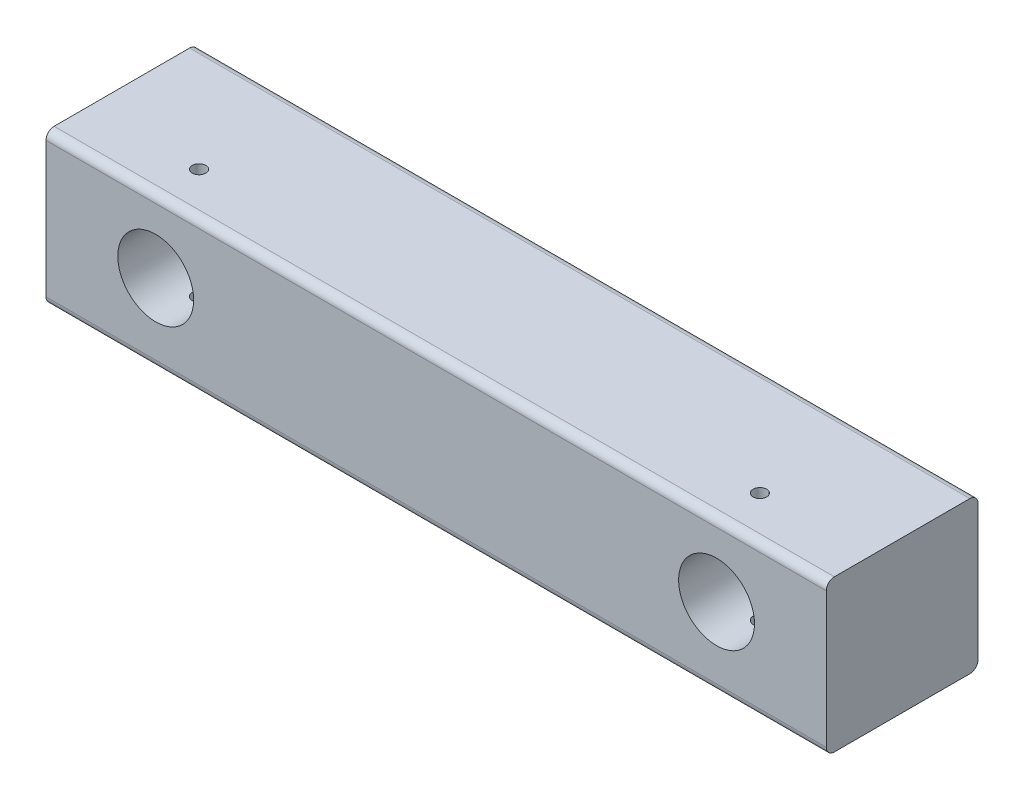
ISO-10303-21;
HEADER;
FILE_DESCRIPTION(('STEP AP214'),'2;1');
FILE_NAME('part.step','',(''),(''),'','','');
FILE_SCHEMA(('AUTOMOTIVE_DESIGN { 1 0 10303 214 1 1 1 1 }'));
ENDSEC;
DATA;
#1=APPLICATION_CONTEXT('core data for automotive mechanical design processes');
#2=APPLICATION_PROTOCOL_DEFINITION('international standard','automotive_design',2000,#1);
#3=PRODUCT_CONTEXT('',#1,'mechanical');
#4=PRODUCT('Part','Part','',(#3));
#5=PRODUCT_RELATED_PRODUCT_CATEGORY('part','',(#4));
#6=PRODUCT_DEFINITION_FORMATION('','',#4);
#7=PRODUCT_DEFINITION_CONTEXT('part definition',#1,'design');
#8=PRODUCT_DEFINITION('design','',#6,#7);
#9=PRODUCT_DEFINITION_SHAPE('','',#8);
#10=(LENGTH_UNIT() NAMED_UNIT(*) SI_UNIT(.MILLI.,.METRE.));
#11=(NAMED_UNIT(*) PLANE_ANGLE_UNIT() SI_UNIT($,.RADIAN.));
#12=(NAMED_UNIT(*) SI_UNIT($,.STERADIAN.) SOLID_ANGLE_UNIT());
#13=UNCERTAINTY_MEASURE_WITH_UNIT(LENGTH_MEASURE(1.E-05),#10,'distance_accuracy_value','');
#14=(GEOMETRIC_REPRESENTATION_CONTEXT(3) GLOBAL_UNCERTAINTY_ASSIGNED_CONTEXT((#13)) GLOBAL_UNIT_ASSIGNED_CONTEXT((#10,
#11,#12)) REPRESENTATION_CONTEXT('',''));
#15=CARTESIAN_POINT('',(0.,0.,0.));
#16=DIRECTION('',(0.,0.,1.));
#17=DIRECTION('',(1.,0.,0.));
#18=AXIS2_PLACEMENT_3D('',#15,#16,#17);
#19=CARTESIAN_POINT('',(0.,0.,-88.9));
#20=DIRECTION('',(0.,0.,-1.));
#21=DIRECTION('',(0.,1.,0.));
#22=AXIS2_PLACEMENT_3D('',#19,#20,#21);
#23=PLANE('',#22);
#24=CARTESIAN_POINT('',(164.309496882,-525.607187924995,-88.9));
#25=DIRECTION('',(0.,0.,1.));
#26=DIRECTION('',(1.,0.,0.));
#27=AXIS2_PLACEMENT_3D('',#24,#25,#26);
#28=CIRCLE('',#27,22.225);
#29=CARTESIAN_POINT('',(186.534496882,-525.607187924995,-88.9));
#30=VERTEX_POINT('',#29);
#31=EDGE_CURVE('E132',#30,#30,#28,.T.);
#32=ORIENTED_EDGE('',*,*,#31,.T.);
#33=EDGE_LOOP('',(#32));
#34=FACE_BOUND('',#33,.T.);
#35=CARTESIAN_POINT('',(-164.309496882,-525.607187924995,-88.9));
#36=DIRECTION('',(0.,0.,1.));
#37=DIRECTION('',(1.,0.,0.));
#38=AXIS2_PLACEMENT_3D('',#35,#36,#37);
#39=CIRCLE('',#38,22.225);
#40=CARTESIAN_POINT('',(-142.084496882,-525.607187924995,-88.9));
#41=VERTEX_POINT('',#40);
#42=EDGE_CURVE('E454',#41,#41,#39,.T.);
#43=ORIENTED_EDGE('',*,*,#42,.T.);
#44=EDGE_LOOP('',(#43));
#45=FACE_BOUND('',#44,.T.);
#46=DIRECTION('',(0.,-1.,0.));
#47=VECTOR('',#46,1.);
#48=CARTESIAN_POINT('',(-228.6,-571.993937924995,-88.9));
#49=LINE('',#48,#47);
#50=CARTESIAN_POINT('',(-228.6,-487.856437924995,-88.9));
#51=VERTEX_POINT('',#50);
#52=CARTESIAN_POINT('',(-228.6,-567.231437924995,-88.9));
#53=VERTEX_POINT('',#52);
#54=EDGE_CURVE('E144',#51,#53,#49,.T.);
#55=ORIENTED_EDGE('',*,*,#54,.F.);
#56=DIRECTION('',(-1.,0.,0.));
#57=VECTOR('',#56,1.);
#58=CARTESIAN_POINT('',(0.,-487.856437924995,-88.9));
#59=LINE('',#58,#57);
#60=CARTESIAN_POINT('',(228.6,-487.856437924995,-88.9));
#61=VERTEX_POINT('',#60);
#62=EDGE_CURVE('E11',#51,#61,#59,.F.);
#63=ORIENTED_EDGE('',*,*,#62,.T.);
#64=DIRECTION('',(0.,1.,0.));
#65=VECTOR('',#64,1.);
#66=CARTESIAN_POINT('',(228.6,-571.993937924995,-88.9));
#67=LINE('',#66,#65);
#68=CARTESIAN_POINT('',(228.6,-567.231437924995,-88.9));
#69=VERTEX_POINT('',#68);
#70=EDGE_CURVE('E148',#69,#61,#67,.T.);
#71=ORIENTED_EDGE('',*,*,#70,.F.);
#72=DIRECTION('',(1.,0.,0.));
#73=VECTOR('',#72,1.);
#74=CARTESIAN_POINT('',(0.,-567.231437924995,-88.9));
#75=LINE('',#74,#73);
#76=EDGE_CURVE('E47',#69,#53,#75,.F.);
#77=ORIENTED_EDGE('',*,*,#76,.T.);
#78=EDGE_LOOP('',(#55,#63,#71,#77));
#79=FACE_BOUND('',#78,.T.);
#80=ADVANCED_FACE('F38',(#34,#45,#79),#23,.T.);
#81=CARTESIAN_POINT('',(0.,0.,0.));
#82=DIRECTION('',(0.,0.,-1.));
#83=DIRECTION('',(-1.,0.,0.));
#84=AXIS2_PLACEMENT_3D('',#81,#82,#83);
#85=PLANE('',#84);
#86=CARTESIAN_POINT('',(164.309496882,-525.607187924995,0.));
#87=DIRECTION('',(0.,0.,1.));
#88=DIRECTION('',(1.,0.,0.));
#89=AXIS2_PLACEMENT_3D('',#86,#87,#88);
#90=CIRCLE('',#89,22.225);
#91=CARTESIAN_POINT('',(186.534496882,-525.607187924995,0.));
#92=VERTEX_POINT('',#91);
#93=EDGE_CURVE('E140',#92,#92,#90,.T.);
#94=ORIENTED_EDGE('',*,*,#93,.F.);
#95=EDGE_LOOP('',(#94));
#96=FACE_BOUND('',#95,.T.);
#97=CARTESIAN_POINT('',(-164.309496882,-525.607187924995,0.));
#98=DIRECTION('',(0.,0.,1.));
#99=DIRECTION('',(1.,0.,0.));
#100=AXIS2_PLACEMENT_3D('',#97,#98,#99);
#101=CIRCLE('',#100,22.225);
#102=CARTESIAN_POINT('',(-142.084496882,-525.607187924995,0.));
#103=VERTEX_POINT('',#102);
#104=EDGE_CURVE('E459',#103,#103,#101,.T.);
#105=ORIENTED_EDGE('',*,*,#104,.F.);
#106=EDGE_LOOP('',(#105));
#107=FACE_BOUND('',#106,.T.);
#108=DIRECTION('',(0.,-1.,0.));
#109=VECTOR('',#108,1.);
#110=CARTESIAN_POINT('',(-228.6,-571.993937924995,0.));
#111=LINE('',#110,#109);
#112=CARTESIAN_POINT('',(-228.6,-487.856437924995,0.));
#113=VERTEX_POINT('',#112);
#114=CARTESIAN_POINT('',(-228.6,-567.231437924995,0.));
#115=VERTEX_POINT('',#114);
#116=EDGE_CURVE('E119',#113,#115,#111,.T.);
#117=ORIENTED_EDGE('',*,*,#116,.T.);
#118=DIRECTION('',(1.,0.,0.));
#119=VECTOR('',#118,1.);
#120=CARTESIAN_POINT('',(228.6,-567.231437924995,0.));
#121=LINE('',#120,#119);
#122=CARTESIAN_POINT('',(228.6,-567.231437924995,0.));
#123=VERTEX_POINT('',#122);
#124=EDGE_CURVE('E124',#115,#123,#121,.T.);
#125=ORIENTED_EDGE('',*,*,#124,.T.);
#126=DIRECTION('',(0.,1.,0.));
#127=VECTOR('',#126,1.);
#128=CARTESIAN_POINT('',(228.6,-571.993937924995,0.));
#129=LINE('',#128,#127);
#130=CARTESIAN_POINT('',(228.6,-487.856437924995,0.));
#131=VERTEX_POINT('',#130);
#132=EDGE_CURVE('E122',#123,#131,#129,.T.);
#133=ORIENTED_EDGE('',*,*,#132,.T.);
#134=DIRECTION('',(-1.,0.,0.));
#135=VECTOR('',#134,1.);
#136=CARTESIAN_POINT('',(-228.6,-487.856437924995,0.));
#137=LINE('',#136,#135);
#138=EDGE_CURVE('E106',#131,#113,#137,.T.);
#139=ORIENTED_EDGE('',*,*,#138,.T.);
#140=EDGE_LOOP('',(#117,#125,#133,#139));
#141=FACE_BOUND('',#140,.T.);
#142=ADVANCED_FACE('F117',(#96,#107,#141),#85,.F.);
#143=CARTESIAN_POINT('',(-228.6,-571.993937924995,-554.662868850663));
#144=DIRECTION('',(0.,-1.,0.));
#145=DIRECTION('',(0.,0.,-1.));
#146=AXIS2_PLACEMENT_3D('',#143,#144,#145);
#147=PLANE('',#146);
#148=CARTESIAN_POINT('',(-164.309496882,-571.993937924995,-25.4));
#149=DIRECTION('',(0.,1.,0.));
#150=DIRECTION('',(0.,0.,1.));
#151=AXIS2_PLACEMENT_3D('',#148,#149,#150);
#152=CIRCLE('',#151,3.96874999999997);
#153=CARTESIAN_POINT('',(-164.309496882,-571.993937924995,-21.43125));
#154=VERTEX_POINT('',#153);
#155=EDGE_CURVE('E482',#154,#154,#152,.T.);
#156=ORIENTED_EDGE('',*,*,#155,.T.);
#157=EDGE_LOOP('',(#156));
#158=FACE_BOUND('',#157,.T.);
#159=CARTESIAN_POINT('',(164.309496882,-571.993937924995,-25.4));
#160=DIRECTION('',(0.,1.,0.));
#161=DIRECTION('',(0.,0.,1.));
#162=AXIS2_PLACEMENT_3D('',#159,#160,#161);
#163=CIRCLE('',#162,3.96874999999997);
#164=CARTESIAN_POINT('',(164.309496882,-571.993937924995,-21.43125));
#165=VERTEX_POINT('',#164);
#166=EDGE_CURVE('E173',#165,#165,#163,.T.);
#167=ORIENTED_EDGE('',*,*,#166,.T.);
#168=EDGE_LOOP('',(#167));
#169=FACE_BOUND('',#168,.T.);
#170=DIRECTION('',(0.,0.,1.));
#171=VECTOR('',#170,1.);
#172=CARTESIAN_POINT('',(228.6,-571.993937924995,-554.662868850663));
#173=LINE('',#172,#171);
#174=CARTESIAN_POINT('',(228.6,-571.993937924995,-84.1375));
#175=VERTEX_POINT('',#174);
#176=CARTESIAN_POINT('',(228.6,-571.993937924995,-4.7625));
#177=VERTEX_POINT('',#176);
#178=EDGE_CURVE('E137',#175,#177,#173,.T.);
#179=ORIENTED_EDGE('',*,*,#178,.T.);
#180=DIRECTION('',(1.,0.,0.));
#181=VECTOR('',#180,1.);
#182=CARTESIAN_POINT('',(-228.6,-571.993937924995,-4.7625));
#183=LINE('',#182,#181);
#184=CARTESIAN_POINT('',(-228.6,-571.993937924995,-4.7625));
#185=VERTEX_POINT('',#184);
#186=EDGE_CURVE('E112',#177,#185,#183,.F.);
#187=ORIENTED_EDGE('',*,*,#186,.T.);
#188=DIRECTION('',(0.,0.,1.));
#189=VECTOR('',#188,1.);
#190=CARTESIAN_POINT('',(-228.6,-571.993937924995,-554.662868850663));
#191=LINE('',#190,#189);
#192=CARTESIAN_POINT('',(-228.6,-571.993937924995,-84.1375));
#193=VERTEX_POINT('',#192);
#194=EDGE_CURVE('E125',#193,#185,#191,.T.);
#195=ORIENTED_EDGE('',*,*,#194,.F.);
#196=DIRECTION('',(1.,0.,0.));
#197=VECTOR('',#196,1.);
#198=CARTESIAN_POINT('',(-228.6,-571.993937924995,-84.1375));
#199=LINE('',#198,#197);
#200=EDGE_CURVE('E249',#193,#175,#199,.T.);
#201=ORIENTED_EDGE('',*,*,#200,.T.);
#202=EDGE_LOOP('',(#179,#187,#195,#201));
#203=FACE_BOUND('',#202,.T.);
#204=ADVANCED_FACE('F216',(#158,#169,#203),#147,.T.);
#205=CARTESIAN_POINT('',(228.6,-571.993937924995,-554.662868850663));
#206=DIRECTION('',(1.,0.,0.));
#207=DIRECTION('',(0.,0.,-1.));
#208=AXIS2_PLACEMENT_3D('',#205,#206,#207);
#209=PLANE('',#208);
#210=ORIENTED_EDGE('',*,*,#132,.F.);
#211=CARTESIAN_POINT('',(228.6,-567.231437924995,-4.7625));
#212=DIRECTION('',(1.,0.,0.));
#213=DIRECTION('',(0.,0.,-1.));
#214=AXIS2_PLACEMENT_3D('',#211,#212,#213);
#215=CIRCLE('',#214,4.7625);
#216=EDGE_CURVE('E286',#123,#177,#215,.T.);
#217=ORIENTED_EDGE('',*,*,#216,.T.);
#218=ORIENTED_EDGE('',*,*,#178,.F.);
#219=CARTESIAN_POINT('',(228.6,-567.231437924995,-84.1375));
#220=DIRECTION('',(1.,0.,0.));
#221=DIRECTION('',(0.,0.,-1.));
#222=AXIS2_PLACEMENT_3D('',#219,#220,#221);
#223=CIRCLE('',#222,4.7625);
#224=EDGE_CURVE('E279',#175,#69,#223,.T.);
#225=ORIENTED_EDGE('',*,*,#224,.T.);
#226=ORIENTED_EDGE('',*,*,#70,.T.);
#227=CARTESIAN_POINT('',(228.6,-487.856437924995,-84.1375));
#228=DIRECTION('',(1.,0.,0.));
#229=DIRECTION('',(0.,0.,-1.));
#230=AXIS2_PLACEMENT_3D('',#227,#228,#229);
#231=CIRCLE('',#230,4.7625);
#232=CARTESIAN_POINT('',(228.6,-483.093937924995,-84.1375));
#233=VERTEX_POINT('',#232);
#234=EDGE_CURVE('E277',#61,#233,#231,.T.);
#235=ORIENTED_EDGE('',*,*,#234,.T.);
#236=DIRECTION('',(0.,0.,1.));
#237=VECTOR('',#236,1.);
#238=CARTESIAN_POINT('',(228.6,-483.093937924995,-554.662868850663));
#239=LINE('',#238,#237);
#240=CARTESIAN_POINT('',(228.6,-483.093937924995,-4.7625));
#241=VERTEX_POINT('',#240);
#242=EDGE_CURVE('E152',#233,#241,#239,.T.);
#243=ORIENTED_EDGE('',*,*,#242,.T.);
#244=CARTESIAN_POINT('',(228.6,-487.856437924995,-4.7625));
#245=DIRECTION('',(1.,0.,0.));
#246=DIRECTION('',(0.,0.,-1.));
#247=AXIS2_PLACEMENT_3D('',#244,#245,#246);
#248=CIRCLE('',#247,4.7625);
#249=EDGE_CURVE('E281',#241,#131,#248,.T.);
#250=ORIENTED_EDGE('',*,*,#249,.T.);
#251=EDGE_LOOP('',(#210,#217,#218,#225,#226,#235,#243,#250));
#252=FACE_BOUND('',#251,.T.);
#253=ADVANCED_FACE('F223',(#252),#209,.T.);
#254=CARTESIAN_POINT('',(-228.6,-483.093937924995,-554.662868850663));
#255=DIRECTION('',(0.,1.,0.));
#256=DIRECTION('',(0.,0.,1.));
#257=AXIS2_PLACEMENT_3D('',#254,#255,#256);
#258=PLANE('',#257);
#259=CARTESIAN_POINT('',(-164.309496882,-483.093937924995,-25.4));
#260=DIRECTION('',(0.,1.,0.));
#261=DIRECTION('',(0.,0.,1.));
#262=AXIS2_PLACEMENT_3D('',#259,#260,#261);
#263=CIRCLE('',#262,3.96874999999999);
#264=CARTESIAN_POINT('',(-164.309496882,-483.093937924995,-21.43125));
#265=VERTEX_POINT('',#264);
#266=EDGE_CURVE('E486',#265,#265,#263,.T.);
#267=ORIENTED_EDGE('',*,*,#266,.F.);
#268=EDGE_LOOP('',(#267));
#269=FACE_BOUND('',#268,.T.);
#270=CARTESIAN_POINT('',(164.309496882,-483.093937924995,-25.4));
#271=DIRECTION('',(0.,1.,0.));
#272=DIRECTION('',(0.,0.,1.));
#273=AXIS2_PLACEMENT_3D('',#270,#271,#272);
#274=CIRCLE('',#273,3.96874999999999);
#275=CARTESIAN_POINT('',(164.309496882,-483.093937924995,-21.43125));
#276=VERTEX_POINT('',#275);
#277=EDGE_CURVE('E206',#276,#276,#274,.T.);
#278=ORIENTED_EDGE('',*,*,#277,.F.);
#279=EDGE_LOOP('',(#278));
#280=FACE_BOUND('',#279,.T.);
#281=ORIENTED_EDGE('',*,*,#242,.F.);
#282=DIRECTION('',(-1.,0.,0.));
#283=VECTOR('',#282,1.);
#284=CARTESIAN_POINT('',(-228.6,-483.093937924995,-84.1375));
#285=LINE('',#284,#283);
#286=CARTESIAN_POINT('',(-228.6,-483.093937924995,-84.1375));
#287=VERTEX_POINT('',#286);
#288=EDGE_CURVE('E262',#233,#287,#285,.T.);
#289=ORIENTED_EDGE('',*,*,#288,.T.);
#290=DIRECTION('',(0.,0.,1.));
#291=VECTOR('',#290,1.);
#292=CARTESIAN_POINT('',(-228.6,-483.093937924995,-554.662868850663));
#293=LINE('',#292,#291);
#294=CARTESIAN_POINT('',(-228.6,-483.093937924995,-4.7625));
#295=VERTEX_POINT('',#294);
#296=EDGE_CURVE('E147',#287,#295,#293,.T.);
#297=ORIENTED_EDGE('',*,*,#296,.T.);
#298=DIRECTION('',(-1.,0.,0.));
#299=VECTOR('',#298,1.);
#300=CARTESIAN_POINT('',(228.6,-483.093937924995,-4.7625));
#301=LINE('',#300,#299);
#302=EDGE_CURVE('E107',#295,#241,#301,.F.);
#303=ORIENTED_EDGE('',*,*,#302,.T.);
#304=EDGE_LOOP('',(#281,#289,#297,#303));
#305=FACE_BOUND('',#304,.T.);
#306=ADVANCED_FACE('F220',(#269,#280,#305),#258,.T.);
#307=CARTESIAN_POINT('',(-228.6,-571.993937924995,-554.662868850663));
#308=DIRECTION('',(-1.,0.,0.));
#309=DIRECTION('',(0.,0.,1.));
#310=AXIS2_PLACEMENT_3D('',#307,#308,#309);
#311=PLANE('',#310);
#312=ORIENTED_EDGE('',*,*,#194,.T.);
#313=CARTESIAN_POINT('',(-228.6,-567.231437924995,-4.7625));
#314=DIRECTION('',(-1.,0.,0.));
#315=DIRECTION('',(0.,0.,1.));
#316=AXIS2_PLACEMENT_3D('',#313,#314,#315);
#317=CIRCLE('',#316,4.7625);
#318=EDGE_CURVE('E130',#185,#115,#317,.T.);
#319=ORIENTED_EDGE('',*,*,#318,.T.);
#320=ORIENTED_EDGE('',*,*,#116,.F.);
#321=CARTESIAN_POINT('',(-228.6,-487.856437924995,-4.7625));
#322=DIRECTION('',(-1.,0.,0.));
#323=DIRECTION('',(0.,0.,1.));
#324=AXIS2_PLACEMENT_3D('',#321,#322,#323);
#325=CIRCLE('',#324,4.7625);
#326=EDGE_CURVE('E103',#113,#295,#325,.T.);
#327=ORIENTED_EDGE('',*,*,#326,.T.);
#328=ORIENTED_EDGE('',*,*,#296,.F.);
#329=CARTESIAN_POINT('',(-228.6,-487.856437924995,-84.1375));
#330=DIRECTION('',(-1.,0.,0.));
#331=DIRECTION('',(0.,0.,1.));
#332=AXIS2_PLACEMENT_3D('',#329,#330,#331);
#333=CIRCLE('',#332,4.7625);
#334=EDGE_CURVE('E60',#287,#51,#333,.T.);
#335=ORIENTED_EDGE('',*,*,#334,.T.);
#336=ORIENTED_EDGE('',*,*,#54,.T.);
#337=CARTESIAN_POINT('',(-228.6,-567.231437924995,-84.1375));
#338=DIRECTION('',(-1.,0.,0.));
#339=DIRECTION('',(0.,0.,1.));
#340=AXIS2_PLACEMENT_3D('',#337,#338,#339);
#341=CIRCLE('',#340,4.7625);
#342=EDGE_CURVE('E111',#53,#193,#341,.T.);
#343=ORIENTED_EDGE('',*,*,#342,.T.);
#344=EDGE_LOOP('',(#312,#319,#320,#327,#328,#335,#336,#343));
#345=FACE_BOUND('',#344,.T.);
#346=ADVANCED_FACE('F128',(#345),#311,.T.);
#347=CARTESIAN_POINT('',(-164.309496882,-525.607187924995,-88.9));
#348=DIRECTION('',(0.,0.,1.));
#349=DIRECTION('',(1.,0.,0.));
#350=AXIS2_PLACEMENT_3D('',#347,#348,#349);
#351=CYLINDRICAL_SURFACE('',#350,22.225);
#352=CARTESIAN_POINT('',(-164.309496882,-547.832187924995,-21.43125));
#353=CARTESIAN_POINT('',(-164.530539723004,-547.832184000619,-21.4312586401309));
#354=CARTESIAN_POINT('',(-164.751697227593,-547.828856109478,-21.4497791451399));
#355=CARTESIAN_POINT('',(-165.187793102213,-547.815901114411,-21.5233316141319));
#356=CARTESIAN_POINT('',(-165.402725842524,-547.806268483454,-21.5783956144551));
#357=CARTESIAN_POINT('',(-165.820001093655,-547.781782823664,-21.7233059202654));
#358=CARTESIAN_POINT('',(-166.022354327872,-547.766934314968,-21.8131221159348));
#359=CARTESIAN_POINT('',(-166.409097305582,-547.733643279863,-22.0249046550446));
#360=CARTESIAN_POINT('',(-166.593488764642,-547.715201097199,-22.1468679239167));
#361=CARTESIAN_POINT('',(-166.941107448157,-547.676537240423,-22.4208962506653));
#362=CARTESIAN_POINT('',(-167.104110324237,-547.656299942581,-22.5732437311701));
#363=CARTESIAN_POINT('',(-167.402385211821,-547.616444271707,-22.9031081648908));
#364=CARTESIAN_POINT('',(-167.537655341539,-547.596825940751,-23.0806268246981));
#365=CARTESIAN_POINT('',(-167.777543103891,-547.560277912596,-23.4573605609177));
#366=CARTESIAN_POINT('',(-167.8819353165,-547.543368381872,-23.6567213029918));
#367=CARTESIAN_POINT('',(-168.055661572932,-547.514371257378,-24.0705023393799));
#368=CARTESIAN_POINT('',(-168.124998347606,-547.502283288021,-24.2849214591491));
#369=CARTESIAN_POINT('',(-168.225931249032,-547.484454481447,-24.7203417539961));
#370=CARTESIAN_POINT('',(-168.257916937327,-547.478648176016,-24.9412498937873));
#371=CARTESIAN_POINT('',(-168.284448301456,-547.473842455249,-25.3853678886866));
#372=CARTESIAN_POINT('',(-168.278997019875,-547.474842486747,-25.6085775552725));
#373=CARTESIAN_POINT('',(-168.231125698518,-547.48347676658,-26.0481586246805));
#374=CARTESIAN_POINT('',(-168.189146247321,-547.491031946148,-26.2645797895286));
#375=CARTESIAN_POINT('',(-168.070103016254,-547.511801241172,-26.6872571354414));
#376=CARTESIAN_POINT('',(-167.993037871933,-547.525015576705,-26.893512920838));
#377=CARTESIAN_POINT('',(-167.805573008267,-547.555698139892,-27.2913069852049));
#378=CARTESIAN_POINT('',(-167.694993157032,-547.573189253298,-27.4827585370541));
#379=CARTESIAN_POINT('',(-167.443765445275,-547.6104391088,-27.844555534767));
#380=CARTESIAN_POINT('',(-167.30311480859,-547.630198060188,-28.0148990296199));
#381=CARTESIAN_POINT('',(-166.993351510892,-547.670103079664,-28.3321922207374));
#382=CARTESIAN_POINT('',(-166.823861474033,-547.690250649319,-28.4787735572925));
#383=CARTESIAN_POINT('',(-166.462499309227,-547.728403105903,-28.7414749859914));
#384=CARTESIAN_POINT('',(-166.270626994675,-547.746407974965,-28.8575948241448));
#385=CARTESIAN_POINT('',(-165.869579368589,-547.778277756257,-29.0561220751178));
#386=CARTESIAN_POINT('',(-165.660385986624,-547.792138273542,-29.1384937331479));
#387=CARTESIAN_POINT('',(-165.230830131145,-547.814123159198,-29.2668275504797));
#388=CARTESIAN_POINT('',(-165.010468734379,-547.822248079436,-29.3127932127407));
#389=CARTESIAN_POINT('',(-164.568003771293,-547.83177121633,-29.3665034430965));
#390=CARTESIAN_POINT('',(-164.345963371579,-547.833258327389,-29.37475314482));
#391=CARTESIAN_POINT('',(-163.903674791911,-547.829582922889,-29.3541485881257));
#392=CARTESIAN_POINT('',(-163.683426532834,-547.824420702519,-29.3252959768182));
#393=CARTESIAN_POINT('',(-163.252557940065,-547.808081869981,-29.2317258923966));
#394=CARTESIAN_POINT('',(-163.041880878068,-547.79694772783,-29.1672615802417));
#395=CARTESIAN_POINT('',(-162.634324548622,-547.769908287485,-29.0045701495806));
#396=CARTESIAN_POINT('',(-162.437446149337,-547.754002689418,-28.9063409089945));
#397=CARTESIAN_POINT('',(-162.060902986521,-547.718963200154,-28.6777728086266));
#398=CARTESIAN_POINT('',(-161.881430350458,-547.699798574866,-28.5471222434305));
#399=CARTESIAN_POINT('',(-161.546775982049,-547.660451667494,-28.2578450414398));
#400=CARTESIAN_POINT('',(-161.391596295425,-547.640269299893,-28.0992160509579));
#401=CARTESIAN_POINT('',(-161.10803406254,-547.60086995237,-27.7562072363195));
#402=CARTESIAN_POINT('',(-160.979994760194,-547.581667431653,-27.5715417248734));
#403=CARTESIAN_POINT('',(-160.756754002146,-547.546683457973,-27.183026518));
#404=CARTESIAN_POINT('',(-160.661551400245,-547.530901885604,-26.9791774925105));
#405=CARTESIAN_POINT('',(-160.507185046116,-547.504657947021,-26.5589921974404));
#406=CARTESIAN_POINT('',(-160.447858000571,-547.494171515688,-26.3427174903262));
#407=CARTESIAN_POINT('',(-160.366418409723,-547.479647739819,-25.9030671689553));
#408=CARTESIAN_POINT('',(-160.344302097364,-547.475609742475,-25.679692275824));
#409=CARTESIAN_POINT('',(-160.338028609234,-547.474470968887,-25.2356156308689));
#410=CARTESIAN_POINT('',(-160.353330549439,-547.477271342598,-25.0149215900373));
#411=CARTESIAN_POINT('',(-160.420281485391,-547.489275717869,-24.5793040638963));
#412=CARTESIAN_POINT('',(-160.471930310238,-547.498479689321,-24.3643805514594));
#413=CARTESIAN_POINT('',(-160.609889824388,-547.522214355847,-23.946659821797));
#414=CARTESIAN_POINT('',(-160.696147229829,-547.536736859449,-23.7438445115396));
#415=CARTESIAN_POINT('',(-160.900817928849,-547.569478941969,-23.3554771023942));
#416=CARTESIAN_POINT('',(-161.019233198785,-547.587698748099,-23.1699260654743));
#417=CARTESIAN_POINT('',(-161.286760874068,-547.626092289508,-22.8186344372683));
#418=CARTESIAN_POINT('',(-161.436268866156,-547.646289228702,-22.6531975946076));
#419=CARTESIAN_POINT('',(-161.760908511349,-547.686182761602,-22.3495777830286));
#420=CARTESIAN_POINT('',(-161.936046050363,-547.705879239152,-22.2114010916548));
#421=CARTESIAN_POINT('',(-162.308658321768,-547.742737805255,-21.9651932936352));
#422=CARTESIAN_POINT('',(-162.506301609698,-547.759878202375,-21.8574139632159));
#423=CARTESIAN_POINT('',(-162.917124698198,-547.789482129106,-21.6767581397728));
#424=CARTESIAN_POINT('',(-163.130289283669,-547.80195016711,-21.6038479823726));
#425=CARTESIAN_POINT('',(-163.505060220157,-547.818182958045,-21.5102589012337));
#426=CARTESIAN_POINT('',(-163.664440279571,-547.823405870528,-21.480679770113));
#427=CARTESIAN_POINT('',(-163.985692043138,-547.830409754377,-21.4411723664841));
#428=CARTESIAN_POINT('',(-164.147563693501,-547.832190799943,-21.4312436703494));
#429=CARTESIAN_POINT('',(-164.309496882,-547.832187924995,-21.43125));
#430=B_SPLINE_CURVE_WITH_KNOTS('',3,(#352,#353,#354,#355,#356,#357,#358,#359,#360,#361,#362,
#363,#364,#365,#366,#367,#368,#369,#370,#371,#372,#373,#374,#375,#376,#377,#378,#379,#380,#381,
#382,#383,#384,#385,#386,#387,#388,#389,#390,#391,#392,#393,#394,#395,#396,#397,#398,#399,#400,
#401,#402,#403,#404,#405,#406,#407,#408,#409,#410,#411,#412,#413,#414,#415,#416,#417,#418,#419,
#420,#421,#422,#423,#424,#425,#426,#427,#428,#429),.UNSPECIFIED.,.T.,.F.,(4,2,2,2,2,2,2,2,2,2,2,
2,2,2,2,2,2,2,2,2,2,2,2,2,2,2,2,2,2,2,2,2,2,2,2,2,2,2,4),(0.,0.662536452327345,1.32565449463126,
1.98819928351543,2.65068072913821,3.3196338990258,3.98863244525344,4.66240076645074,
5.33611659235369,6.00274114979633,6.66931152984555,7.32795172752227,7.98661754131183,
8.64888823614722,9.31122009886095,9.98299974902709,10.6547850003654,11.3272801510865,
11.9997105869367,12.663108192618,13.3264763486183,13.9851882498057,14.6439415577134,
15.309291842749,15.974698127151,16.6480747298488,17.3214278252207,17.9916925136016,
18.6618893431769,19.3224558361061,19.9830192231395,20.6425694762409,21.3021602731231,
21.9707216917796,22.6394368893943,23.3135383445744,23.986987669377,24.4723639552993,
24.9577297773034),.UNSPECIFIED.);
#431=CARTESIAN_POINT('',(-164.309496882,-547.832187924995,-21.43125));
#432=VERTEX_POINT('',#431);
#433=EDGE_CURVE('E200',#432,#432,#430,.T.);
#434=ORIENTED_EDGE('',*,*,#433,.T.);
#435=EDGE_LOOP('',(#434));
#436=FACE_BOUND('',#435,.T.);
#437=CARTESIAN_POINT('',(-164.309496882,-503.382187924995,-21.43125));
#438=CARTESIAN_POINT('',(-164.088454040996,-503.382191849371,-21.4312586401309));
#439=CARTESIAN_POINT('',(-163.867296536407,-503.385519740512,-21.4497791451399));
#440=CARTESIAN_POINT('',(-163.431200661787,-503.398474735579,-21.5233316141319));
#441=CARTESIAN_POINT('',(-163.216267921476,-503.408107366536,-21.5783956144551));
#442=CARTESIAN_POINT('',(-162.798992670345,-503.432593026326,-21.7233059202654));
#443=CARTESIAN_POINT('',(-162.596639436128,-503.447441535022,-21.8131221159349));
#444=CARTESIAN_POINT('',(-162.209896458418,-503.480732570127,-22.0249046550446));
#445=CARTESIAN_POINT('',(-162.025504999358,-503.499174752791,-22.1468679239167));
#446=CARTESIAN_POINT('',(-161.677886315843,-503.537838609566,-22.4208962506653));
#447=CARTESIAN_POINT('',(-161.514883439763,-503.558075907409,-22.5732437311701));
#448=CARTESIAN_POINT('',(-161.216608552179,-503.597931578283,-22.9031081648908));
#449=CARTESIAN_POINT('',(-161.081338422461,-503.617549909239,-23.0806268246981));
#450=CARTESIAN_POINT('',(-160.841450660109,-503.654097937394,-23.4573605609177));
#451=CARTESIAN_POINT('',(-160.737058447499,-503.671007468118,-23.6567213029918));
#452=CARTESIAN_POINT('',(-160.563332191068,-503.700004592612,-24.0705023393799));
#453=CARTESIAN_POINT('',(-160.493995416394,-503.712092561969,-24.2849214591491));
#454=CARTESIAN_POINT('',(-160.393062514967,-503.729921368542,-24.7203417539961));
#455=CARTESIAN_POINT('',(-160.361076826673,-503.735727673974,-24.9412498937873));
#456=CARTESIAN_POINT('',(-160.334545462544,-503.740533394741,-25.3853678886866));
#457=CARTESIAN_POINT('',(-160.339996744125,-503.739533363243,-25.6085775552725));
#458=CARTESIAN_POINT('',(-160.387868065482,-503.73089908341,-26.0481586246805));
#459=CARTESIAN_POINT('',(-160.429847516679,-503.723343903842,-26.2645797895286));
#460=CARTESIAN_POINT('',(-160.548890747746,-503.702574608818,-26.6872571354414));
#461=CARTESIAN_POINT('',(-160.625955892067,-503.689360273285,-26.893512920838));
#462=CARTESIAN_POINT('',(-160.813420755732,-503.658677710098,-27.2913069852049));
#463=CARTESIAN_POINT('',(-160.924000606968,-503.641186596692,-27.4827585370541));
#464=CARTESIAN_POINT('',(-161.175228318725,-503.60393674119,-27.844555534767));
#465=CARTESIAN_POINT('',(-161.31587895541,-503.584177789802,-28.0148990296199));
#466=CARTESIAN_POINT('',(-161.625642253108,-503.544272770326,-28.3321922207374));
#467=CARTESIAN_POINT('',(-161.795132289967,-503.524125200671,-28.4787735572925));
#468=CARTESIAN_POINT('',(-162.156494454773,-503.485972744087,-28.7414749859914));
#469=CARTESIAN_POINT('',(-162.348366769325,-503.467967875025,-28.8575948241448));
#470=CARTESIAN_POINT('',(-162.749414395411,-503.436098093733,-29.0561220751178));
#471=CARTESIAN_POINT('',(-162.958607777376,-503.422237576448,-29.1384937331479));
#472=CARTESIAN_POINT('',(-163.388163632855,-503.400252690792,-29.2668275504797));
#473=CARTESIAN_POINT('',(-163.608525029621,-503.392127770554,-29.3127932127407));
#474=CARTESIAN_POINT('',(-164.050989992706,-503.38260463366,-29.3665034430965));
#475=CARTESIAN_POINT('',(-164.273030392421,-503.381117522601,-29.37475314482));
#476=CARTESIAN_POINT('',(-164.715318972089,-503.3847929271,-29.3541485881257));
#477=CARTESIAN_POINT('',(-164.935567231166,-503.389955147471,-29.3252959768182));
#478=CARTESIAN_POINT('',(-165.366435823935,-503.406293980008,-29.2317258923966));
#479=CARTESIAN_POINT('',(-165.577112885932,-503.417428122159,-29.1672615802417));
#480=CARTESIAN_POINT('',(-165.984669215378,-503.444467562505,-29.0045701495806));
#481=CARTESIAN_POINT('',(-166.181547614663,-503.460373160572,-28.9063409089945));
#482=CARTESIAN_POINT('',(-166.558090777479,-503.495412649836,-28.6777728086266));
#483=CARTESIAN_POINT('',(-166.737563413542,-503.514577275124,-28.5471222434305));
#484=CARTESIAN_POINT('',(-167.072217781951,-503.553924182496,-28.2578450414398));
#485=CARTESIAN_POINT('',(-167.227397468575,-503.574106550097,-28.0992160509579));
#486=CARTESIAN_POINT('',(-167.51095970146,-503.61350589762,-27.7562072363195));
#487=CARTESIAN_POINT('',(-167.638999003806,-503.632708418337,-27.5715417248734));
#488=CARTESIAN_POINT('',(-167.862239761854,-503.667692392017,-27.183026518));
#489=CARTESIAN_POINT('',(-167.957442363755,-503.683473964386,-26.9791774925105));
#490=CARTESIAN_POINT('',(-168.111808717884,-503.709717902969,-26.5589921974404));
#491=CARTESIAN_POINT('',(-168.171135763429,-503.720204334302,-26.3427174903262));
#492=CARTESIAN_POINT('',(-168.252575354277,-503.734728110171,-25.9030671689553));
#493=CARTESIAN_POINT('',(-168.274691666636,-503.738766107515,-25.679692275824));
#494=CARTESIAN_POINT('',(-168.280965154766,-503.739904881103,-25.2356156308689));
#495=CARTESIAN_POINT('',(-168.265663214561,-503.737104507392,-25.0149215900373));
#496=CARTESIAN_POINT('',(-168.198712278609,-503.72510013212,-24.5793040638963));
#497=CARTESIAN_POINT('',(-168.147063453762,-503.715896160669,-24.3643805514594));
#498=CARTESIAN_POINT('',(-168.009103939612,-503.692161494143,-23.946659821797));
#499=CARTESIAN_POINT('',(-167.922846534171,-503.677638990541,-23.7438445115396));
#500=CARTESIAN_POINT('',(-167.718175835151,-503.644896908021,-23.3554771023942));
#501=CARTESIAN_POINT('',(-167.599760565215,-503.626677101891,-23.1699260654743));
#502=CARTESIAN_POINT('',(-167.332232889932,-503.588283560482,-22.8186344372683));
#503=CARTESIAN_POINT('',(-167.182724897844,-503.568086621288,-22.6531975946076));
#504=CARTESIAN_POINT('',(-166.858085252651,-503.528193088388,-22.3495777830286));
#505=CARTESIAN_POINT('',(-166.682947713637,-503.508496610838,-22.2114010916548));
#506=CARTESIAN_POINT('',(-166.310335442232,-503.471638044735,-21.9651932936352));
#507=CARTESIAN_POINT('',(-166.112692154302,-503.454497647615,-21.8574139632159));
#508=CARTESIAN_POINT('',(-165.701869065802,-503.424893720884,-21.6767581397728));
#509=CARTESIAN_POINT('',(-165.488704480331,-503.41242568288,-21.6038479823726));
#510=CARTESIAN_POINT('',(-165.113933543843,-503.396192891945,-21.5102589012337));
#511=CARTESIAN_POINT('',(-164.954553484429,-503.390969979462,-21.480679770113));
#512=CARTESIAN_POINT('',(-164.633301720862,-503.383966095613,-21.4411723664841));
#513=CARTESIAN_POINT('',(-164.471430070499,-503.382185050047,-21.4312436703494));
#514=CARTESIAN_POINT('',(-164.309496882,-503.382187924995,-21.43125));
#515=B_SPLINE_CURVE_WITH_KNOTS('',3,(#437,#438,#439,#440,#441,#442,#443,#444,#445,#446,#447,
#448,#449,#450,#451,#452,#453,#454,#455,#456,#457,#458,#459,#460,#461,#462,#463,#464,#465,#466,
#467,#468,#469,#470,#471,#472,#473,#474,#475,#476,#477,#478,#479,#480,#481,#482,#483,#484,#485,
#486,#487,#488,#489,#490,#491,#492,#493,#494,#495,#496,#497,#498,#499,#500,#501,#502,#503,#504,
#505,#506,#507,#508,#509,#510,#511,#512,#513,#514),.UNSPECIFIED.,.T.,.F.,(4,2,2,2,2,2,2,2,2,2,2,
2,2,2,2,2,2,2,2,2,2,2,2,2,2,2,2,2,2,2,2,2,2,2,2,2,2,2,4),(0.,0.662536452327345,1.32565449463126,
1.98819928351543,2.6506807291382,3.31963389902577,3.98863244525344,4.66240076645074,
5.33611659235369,6.00274114979632,6.66931152984555,7.32795172752226,7.98661754131183,
8.64888823614722,9.31122009886094,9.98299974902709,10.6547850003654,11.3272801510865,
11.9997105869367,12.663108192618,13.3264763486182,13.9851882498056,14.6439415577134,
15.309291842749,15.974698127151,16.6480747298488,17.3214278252207,17.9916925136016,
18.6618893431769,19.3224558361061,19.9830192231394,20.6425694762409,21.3021602731231,
21.9707216917796,22.6394368893943,23.3135383445744,23.986987669377,24.4723639552993,
24.9577297773034),.UNSPECIFIED.);
#516=CARTESIAN_POINT('',(-164.309496882,-503.382187924995,-21.43125));
#517=VERTEX_POINT('',#516);
#518=EDGE_CURVE('E195',#517,#517,#515,.T.);
#519=ORIENTED_EDGE('',*,*,#518,.T.);
#520=EDGE_LOOP('',(#519));
#521=FACE_BOUND('',#520,.T.);
#522=ORIENTED_EDGE('',*,*,#42,.F.);
#523=EDGE_LOOP('',(#522));
#524=FACE_BOUND('',#523,.T.);
#525=ORIENTED_EDGE('',*,*,#104,.T.);
#526=EDGE_LOOP('',(#525));
#527=FACE_BOUND('',#526,.T.);
#528=ADVANCED_FACE('F208',(#436,#521,#524,#527),#351,.F.);
#529=CARTESIAN_POINT('',(164.309496882,-525.607187924995,-88.9));
#530=DIRECTION('',(0.,0.,1.));
#531=DIRECTION('',(1.,0.,0.));
#532=AXIS2_PLACEMENT_3D('',#529,#530,#531);
#533=CYLINDRICAL_SURFACE('',#532,22.225);
#534=CARTESIAN_POINT('',(164.309496882,-547.832187924995,-21.43125));
#535=CARTESIAN_POINT('',(164.088454040996,-547.832184000619,-21.4312586401309));
#536=CARTESIAN_POINT('',(163.867296536407,-547.828856109477,-21.44977914514));
#537=CARTESIAN_POINT('',(163.431200661787,-547.815901114411,-21.5233316141319));
#538=CARTESIAN_POINT('',(163.216267921476,-547.806268483454,-21.5783956144551));
#539=CARTESIAN_POINT('',(162.798992670345,-547.781782823664,-21.7233059202654));
#540=CARTESIAN_POINT('',(162.596639436128,-547.766934314968,-21.8131221159349));
#541=CARTESIAN_POINT('',(162.209896458418,-547.733643279863,-22.0249046550446));
#542=CARTESIAN_POINT('',(162.025504999358,-547.715201097199,-22.1468679239167));
#543=CARTESIAN_POINT('',(161.677886315843,-547.676537240423,-22.4208962506654));
#544=CARTESIAN_POINT('',(161.514883439763,-547.656299942581,-22.5732437311701));
#545=CARTESIAN_POINT('',(161.216608552179,-547.616444271707,-22.9031081648908));
#546=CARTESIAN_POINT('',(161.081338422461,-547.596825940751,-23.0806268246981));
#547=CARTESIAN_POINT('',(160.841450660109,-547.560277912596,-23.4573605609177));
#548=CARTESIAN_POINT('',(160.7370584475,-547.543368381872,-23.6567213029918));
#549=CARTESIAN_POINT('',(160.563332191068,-547.514371257378,-24.0705023393799));
#550=CARTESIAN_POINT('',(160.493995416394,-547.50228328802,-24.2849214591491));
#551=CARTESIAN_POINT('',(160.393062514968,-547.484454481447,-24.7203417539961));
#552=CARTESIAN_POINT('',(160.361076826673,-547.478648176016,-24.9412498937873));
#553=CARTESIAN_POINT('',(160.334545462544,-547.473842455249,-25.3853678886867));
#554=CARTESIAN_POINT('',(160.339996744125,-547.474842486747,-25.6085775552725));
#555=CARTESIAN_POINT('',(160.387868065482,-547.48347676658,-26.0481586246805));
#556=CARTESIAN_POINT('',(160.429847516679,-547.491031946148,-26.2645797895286));
#557=CARTESIAN_POINT('',(160.548890747746,-547.511801241172,-26.6872571354414));
#558=CARTESIAN_POINT('',(160.625955892067,-547.525015576705,-26.893512920838));
#559=CARTESIAN_POINT('',(160.813420755733,-547.555698139892,-27.2913069852049));
#560=CARTESIAN_POINT('',(160.924000606968,-547.573189253298,-27.4827585370541));
#561=CARTESIAN_POINT('',(161.175228318725,-547.6104391088,-27.8445555347671));
#562=CARTESIAN_POINT('',(161.31587895541,-547.630198060188,-28.01489902962));
#563=CARTESIAN_POINT('',(161.625642253108,-547.670103079664,-28.3321922207374));
#564=CARTESIAN_POINT('',(161.795132289967,-547.690250649319,-28.4787735572926));
#565=CARTESIAN_POINT('',(162.156494454773,-547.728403105903,-28.7414749859914));
#566=CARTESIAN_POINT('',(162.348366769325,-547.746407974964,-28.8575948241449));
#567=CARTESIAN_POINT('',(162.749414395411,-547.778277756257,-29.0561220751178));
#568=CARTESIAN_POINT('',(162.958607777376,-547.792138273542,-29.1384937331479));
#569=CARTESIAN_POINT('',(163.388163632855,-547.814123159198,-29.2668275504797));
#570=CARTESIAN_POINT('',(163.608525029621,-547.822248079435,-29.3127932127407));
#571=CARTESIAN_POINT('',(164.050989992707,-547.83177121633,-29.3665034430965));
#572=CARTESIAN_POINT('',(164.273030392421,-547.833258327389,-29.37475314482));
#573=CARTESIAN_POINT('',(164.715318972089,-547.829582922889,-29.3541485881257));
#574=CARTESIAN_POINT('',(164.935567231166,-547.824420702519,-29.3252959768182));
#575=CARTESIAN_POINT('',(165.366435823935,-547.808081869981,-29.2317258923966));
#576=CARTESIAN_POINT('',(165.577112885932,-547.79694772783,-29.1672615802417));
#577=CARTESIAN_POINT('',(165.984669215378,-547.769908287485,-29.0045701495806));
#578=CARTESIAN_POINT('',(166.181547614663,-547.754002689418,-28.9063409089945));
#579=CARTESIAN_POINT('',(166.558090777479,-547.718963200154,-28.6777728086266));
#580=CARTESIAN_POINT('',(166.737563413542,-547.699798574866,-28.5471222434305));
#581=CARTESIAN_POINT('',(167.072217781951,-547.660451667493,-28.2578450414398));
#582=CARTESIAN_POINT('',(167.227397468575,-547.640269299893,-28.0992160509579));
#583=CARTESIAN_POINT('',(167.51095970146,-547.60086995237,-27.7562072363195));
#584=CARTESIAN_POINT('',(167.638999003806,-547.581667431653,-27.5715417248734));
#585=CARTESIAN_POINT('',(167.862239761854,-547.546683457973,-27.183026518));
#586=CARTESIAN_POINT('',(167.957442363755,-547.530901885604,-26.9791774925105));
#587=CARTESIAN_POINT('',(168.111808717884,-547.504657947021,-26.5589921974404));
#588=CARTESIAN_POINT('',(168.171135763429,-547.494171515687,-26.3427174903263));
#589=CARTESIAN_POINT('',(168.252575354277,-547.479647739819,-25.9030671689553));
#590=CARTESIAN_POINT('',(168.274691666636,-547.475609742475,-25.679692275824));
#591=CARTESIAN_POINT('',(168.280965154766,-547.474470968887,-25.2356156308689));
#592=CARTESIAN_POINT('',(168.265663214561,-547.477271342598,-25.0149215900373));
#593=CARTESIAN_POINT('',(168.198712278609,-547.489275717869,-24.5793040638963));
#594=CARTESIAN_POINT('',(168.147063453762,-547.498479689321,-24.3643805514594));
#595=CARTESIAN_POINT('',(168.009103939612,-547.522214355846,-23.946659821797));
#596=CARTESIAN_POINT('',(167.922846534171,-547.536736859448,-23.7438445115396));
#597=CARTESIAN_POINT('',(167.718175835151,-547.569478941969,-23.3554771023942));
#598=CARTESIAN_POINT('',(167.599760565215,-547.587698748099,-23.1699260654743));
#599=CARTESIAN_POINT('',(167.332232889932,-547.626092289508,-22.8186344372683));
#600=CARTESIAN_POINT('',(167.182724897844,-547.646289228702,-22.6531975946076));
#601=CARTESIAN_POINT('',(166.858085252651,-547.686182761602,-22.3495777830286));
#602=CARTESIAN_POINT('',(166.682947713637,-547.705879239152,-22.2114010916548));
#603=CARTESIAN_POINT('',(166.310335442232,-547.742737805255,-21.9651932936353));
#604=CARTESIAN_POINT('',(166.112692154302,-547.759878202375,-21.8574139632159));
#605=CARTESIAN_POINT('',(165.701869065802,-547.789482129106,-21.6767581397728));
#606=CARTESIAN_POINT('',(165.488704480331,-547.80195016711,-21.6038479823726));
#607=CARTESIAN_POINT('',(165.113933543843,-547.818182958045,-21.5102589012337));
#608=CARTESIAN_POINT('',(164.954553484429,-547.823405870528,-21.480679770113));
#609=CARTESIAN_POINT('',(164.633301720862,-547.830409754377,-21.4411723664841));
#610=CARTESIAN_POINT('',(164.471430070499,-547.832190799943,-21.4312436703494));
#611=CARTESIAN_POINT('',(164.309496882,-547.832187924995,-21.43125));
#612=B_SPLINE_CURVE_WITH_KNOTS('',3,(#534,#535,#536,#537,#538,#539,#540,#541,#542,#543,#544,
#545,#546,#547,#548,#549,#550,#551,#552,#553,#554,#555,#556,#557,#558,#559,#560,#561,#562,#563,
#564,#565,#566,#567,#568,#569,#570,#571,#572,#573,#574,#575,#576,#577,#578,#579,#580,#581,#582,
#583,#584,#585,#586,#587,#588,#589,#590,#591,#592,#593,#594,#595,#596,#597,#598,#599,#600,#601,
#602,#603,#604,#605,#606,#607,#608,#609,#610,#611),.UNSPECIFIED.,.T.,.F.,(4,2,2,2,2,2,2,2,2,2,2,
2,2,2,2,2,2,2,2,2,2,2,2,2,2,2,2,2,2,2,2,2,2,2,2,2,2,2,4),(0.,0.662536452327345,1.32565449463126,
1.98819928351543,2.65068072913821,3.31963389902577,3.98863244525344,4.66240076645073,
5.33611659235369,6.00274114979632,6.66931152984553,7.32795172752225,7.98661754131183,
8.64888823614723,9.31122009886095,9.98299974902709,10.6547850003654,11.3272801510865,
11.9997105869367,12.663108192618,13.3264763486183,13.9851882498057,14.6439415577134,
15.309291842749,15.974698127151,16.6480747298488,17.3214278252207,17.9916925136016,
18.6618893431769,19.3224558361062,19.9830192231395,20.6425694762409,21.3021602731232,
21.9707216917796,22.6394368893943,23.3135383445744,23.986987669377,24.4723639552993,
24.9577297773034),.UNSPECIFIED.);
#613=CARTESIAN_POINT('',(164.309496882,-547.832187924995,-21.43125));
#614=VERTEX_POINT('',#613);
#615=EDGE_CURVE('E172',#614,#614,#612,.T.);
#616=ORIENTED_EDGE('',*,*,#615,.T.);
#617=EDGE_LOOP('',(#616));
#618=FACE_BOUND('',#617,.T.);
#619=CARTESIAN_POINT('',(164.309496882,-503.382187924995,-21.43125));
#620=CARTESIAN_POINT('',(164.530539723004,-503.382191849371,-21.4312586401309));
#621=CARTESIAN_POINT('',(164.751697227593,-503.385519740512,-21.44977914514));
#622=CARTESIAN_POINT('',(165.187793102213,-503.398474735579,-21.5233316141319));
#623=CARTESIAN_POINT('',(165.402725842524,-503.408107366535,-21.5783956144551));
#624=CARTESIAN_POINT('',(165.820001093655,-503.432593026325,-21.7233059202654));
#625=CARTESIAN_POINT('',(166.022354327872,-503.447441535022,-21.8131221159349));
#626=CARTESIAN_POINT('',(166.409097305582,-503.480732570127,-22.0249046550446));
#627=CARTESIAN_POINT('',(166.593488764642,-503.49917475279,-22.1468679239167));
#628=CARTESIAN_POINT('',(166.941107448157,-503.537838609566,-22.4208962506654));
#629=CARTESIAN_POINT('',(167.104110324237,-503.558075907409,-22.5732437311701));
#630=CARTESIAN_POINT('',(167.402385211821,-503.597931578283,-22.9031081648908));
#631=CARTESIAN_POINT('',(167.537655341539,-503.617549909239,-23.0806268246981));
#632=CARTESIAN_POINT('',(167.777543103891,-503.654097937393,-23.4573605609177));
#633=CARTESIAN_POINT('',(167.881935316501,-503.671007468118,-23.6567213029918));
#634=CARTESIAN_POINT('',(168.055661572932,-503.700004592612,-24.0705023393799));
#635=CARTESIAN_POINT('',(168.124998347606,-503.712092561969,-24.2849214591491));
#636=CARTESIAN_POINT('',(168.225931249033,-503.729921368542,-24.7203417539961));
#637=CARTESIAN_POINT('',(168.257916937327,-503.735727673974,-24.9412498937873));
#638=CARTESIAN_POINT('',(168.284448301456,-503.740533394741,-25.3853678886867));
#639=CARTESIAN_POINT('',(168.278997019875,-503.739533363243,-25.6085775552725));
#640=CARTESIAN_POINT('',(168.231125698518,-503.73089908341,-26.0481586246805));
#641=CARTESIAN_POINT('',(168.189146247321,-503.723343903841,-26.2645797895286));
#642=CARTESIAN_POINT('',(168.070103016255,-503.702574608818,-26.6872571354414));
#643=CARTESIAN_POINT('',(167.993037871933,-503.689360273285,-26.893512920838));
#644=CARTESIAN_POINT('',(167.805573008268,-503.658677710098,-27.2913069852049));
#645=CARTESIAN_POINT('',(167.694993157032,-503.641186596692,-27.4827585370541));
#646=CARTESIAN_POINT('',(167.443765445275,-503.60393674119,-27.8445555347671));
#647=CARTESIAN_POINT('',(167.30311480859,-503.584177789802,-28.01489902962));
#648=CARTESIAN_POINT('',(166.993351510892,-503.544272770326,-28.3321922207374));
#649=CARTESIAN_POINT('',(166.823861474033,-503.524125200671,-28.4787735572926));
#650=CARTESIAN_POINT('',(166.462499309227,-503.485972744087,-28.7414749859914));
#651=CARTESIAN_POINT('',(166.270626994675,-503.467967875025,-28.8575948241449));
#652=CARTESIAN_POINT('',(165.869579368589,-503.436098093733,-29.0561220751178));
#653=CARTESIAN_POINT('',(165.660385986624,-503.422237576448,-29.1384937331479));
#654=CARTESIAN_POINT('',(165.230830131145,-503.400252690792,-29.2668275504797));
#655=CARTESIAN_POINT('',(165.010468734379,-503.392127770554,-29.3127932127407));
#656=CARTESIAN_POINT('',(164.568003771294,-503.382604633659,-29.3665034430965));
#657=CARTESIAN_POINT('',(164.345963371579,-503.3811175226,-29.37475314482));
#658=CARTESIAN_POINT('',(163.903674791911,-503.3847929271,-29.3541485881257));
#659=CARTESIAN_POINT('',(163.683426532834,-503.389955147471,-29.3252959768182));
#660=CARTESIAN_POINT('',(163.252557940065,-503.406293980008,-29.2317258923966));
#661=CARTESIAN_POINT('',(163.041880878068,-503.417428122159,-29.1672615802417));
#662=CARTESIAN_POINT('',(162.634324548622,-503.444467562505,-29.0045701495806));
#663=CARTESIAN_POINT('',(162.437446149337,-503.460373160571,-28.9063409089945));
#664=CARTESIAN_POINT('',(162.060902986521,-503.495412649836,-28.6777728086266));
#665=CARTESIAN_POINT('',(161.881430350458,-503.514577275124,-28.5471222434305));
#666=CARTESIAN_POINT('',(161.546775982049,-503.553924182496,-28.2578450414398));
#667=CARTESIAN_POINT('',(161.391596295425,-503.574106550097,-28.0992160509579));
#668=CARTESIAN_POINT('',(161.10803406254,-503.61350589762,-27.7562072363195));
#669=CARTESIAN_POINT('',(160.979994760194,-503.632708418337,-27.5715417248734));
#670=CARTESIAN_POINT('',(160.756754002146,-503.667692392017,-27.183026518));
#671=CARTESIAN_POINT('',(160.661551400245,-503.683473964386,-26.9791774925105));
#672=CARTESIAN_POINT('',(160.507185046116,-503.709717902969,-26.5589921974404));
#673=CARTESIAN_POINT('',(160.447858000571,-503.720204334302,-26.3427174903263));
#674=CARTESIAN_POINT('',(160.366418409723,-503.73472811017,-25.9030671689553));
#675=CARTESIAN_POINT('',(160.344302097364,-503.738766107515,-25.679692275824));
#676=CARTESIAN_POINT('',(160.338028609234,-503.739904881103,-25.2356156308689));
#677=CARTESIAN_POINT('',(160.353330549439,-503.737104507392,-25.0149215900373));
#678=CARTESIAN_POINT('',(160.420281485391,-503.72510013212,-24.5793040638963));
#679=CARTESIAN_POINT('',(160.471930310238,-503.715896160669,-24.3643805514594));
#680=CARTESIAN_POINT('',(160.609889824388,-503.692161494143,-23.946659821797));
#681=CARTESIAN_POINT('',(160.696147229829,-503.677638990541,-23.7438445115396));
#682=CARTESIAN_POINT('',(160.900817928849,-503.644896908021,-23.3554771023942));
#683=CARTESIAN_POINT('',(161.019233198785,-503.626677101891,-23.1699260654743));
#684=CARTESIAN_POINT('',(161.286760874068,-503.588283560482,-22.8186344372683));
#685=CARTESIAN_POINT('',(161.436268866156,-503.568086621288,-22.6531975946076));
#686=CARTESIAN_POINT('',(161.760908511349,-503.528193088388,-22.3495777830286));
#687=CARTESIAN_POINT('',(161.936046050363,-503.508496610837,-22.2114010916548));
#688=CARTESIAN_POINT('',(162.308658321768,-503.471638044734,-21.9651932936353));
#689=CARTESIAN_POINT('',(162.506301609698,-503.454497647615,-21.8574139632159));
#690=CARTESIAN_POINT('',(162.917124698198,-503.424893720884,-21.6767581397728));
#691=CARTESIAN_POINT('',(163.130289283669,-503.41242568288,-21.6038479823726));
#692=CARTESIAN_POINT('',(163.505060220157,-503.396192891945,-21.5102589012337));
#693=CARTESIAN_POINT('',(163.664440279571,-503.390969979462,-21.480679770113));
#694=CARTESIAN_POINT('',(163.985692043138,-503.383966095613,-21.4411723664841));
#695=CARTESIAN_POINT('',(164.147563693501,-503.382185050047,-21.4312436703494));
#696=CARTESIAN_POINT('',(164.309496882,-503.382187924995,-21.43125));
#697=B_SPLINE_CURVE_WITH_KNOTS('',3,(#619,#620,#621,#622,#623,#624,#625,#626,#627,#628,#629,
#630,#631,#632,#633,#634,#635,#636,#637,#638,#639,#640,#641,#642,#643,#644,#645,#646,#647,#648,
#649,#650,#651,#652,#653,#654,#655,#656,#657,#658,#659,#660,#661,#662,#663,#664,#665,#666,#667,
#668,#669,#670,#671,#672,#673,#674,#675,#676,#677,#678,#679,#680,#681,#682,#683,#684,#685,#686,
#687,#688,#689,#690,#691,#692,#693,#694,#695,#696),.UNSPECIFIED.,.T.,.F.,(4,2,2,2,2,2,2,2,2,2,2,
2,2,2,2,2,2,2,2,2,2,2,2,2,2,2,2,2,2,2,2,2,2,2,2,2,2,2,4),(0.,0.662536452327345,1.32565449463126,
1.9881992835154,2.6506807291382,3.31963389902577,3.98863244525344,4.66240076645073,
5.33611659235369,6.00274114979632,6.66931152984553,7.32795172752224,7.98661754131183,
8.64888823614723,9.31122009886095,9.98299974902709,10.6547850003654,11.3272801510865,
11.9997105869367,12.663108192618,13.3264763486183,13.9851882498057,14.6439415577134,
15.309291842749,15.974698127151,16.6480747298488,17.3214278252207,17.9916925136016,
18.6618893431769,19.3224558361062,19.9830192231395,20.6425694762409,21.3021602731232,
21.9707216917796,22.6394368893943,23.3135383445744,23.986987669377,24.4723639552993,
24.9577297773034),.UNSPECIFIED.);
#698=CARTESIAN_POINT('',(164.309496882,-503.382187924995,-21.43125));
#699=VERTEX_POINT('',#698);
#700=EDGE_CURVE('E163',#699,#699,#697,.T.);
#701=ORIENTED_EDGE('',*,*,#700,.T.);
#702=EDGE_LOOP('',(#701));
#703=FACE_BOUND('',#702,.T.);
#704=ORIENTED_EDGE('',*,*,#31,.F.);
#705=EDGE_LOOP('',(#704));
#706=FACE_BOUND('',#705,.T.);
#707=ORIENTED_EDGE('',*,*,#93,.T.);
#708=EDGE_LOOP('',(#707));
#709=FACE_BOUND('',#708,.T.);
#710=ADVANCED_FACE('F178',(#618,#703,#706,#709),#533,.F.);
#711=CARTESIAN_POINT('',(164.309496882,-483.093937924995,-25.4));
#712=DIRECTION('',(0.,1.,0.));
#713=DIRECTION('',(0.,0.,1.));
#714=AXIS2_PLACEMENT_3D('',#711,#712,#713);
#715=CYLINDRICAL_SURFACE('',#714,3.96874999999998);
#716=ORIENTED_EDGE('',*,*,#277,.T.);
#717=EDGE_LOOP('',(#716));
#718=FACE_BOUND('',#717,.T.);
#719=ORIENTED_EDGE('',*,*,#700,.F.);
#720=EDGE_LOOP('',(#719));
#721=FACE_BOUND('',#720,.T.);
#722=ADVANCED_FACE('F186',(#718,#721),#715,.F.);
#723=ORIENTED_EDGE('',*,*,#166,.F.);
#724=EDGE_LOOP('',(#723));
#725=FACE_BOUND('',#724,.T.);
#726=ORIENTED_EDGE('',*,*,#615,.F.);
#727=EDGE_LOOP('',(#726));
#728=FACE_BOUND('',#727,.T.);
#729=ADVANCED_FACE('F181',(#725,#728),#715,.F.);
#730=CARTESIAN_POINT('',(-164.309496882,-483.093937924995,-25.4));
#731=DIRECTION('',(0.,1.,0.));
#732=DIRECTION('',(0.,0.,1.));
#733=AXIS2_PLACEMENT_3D('',#730,#731,#732);
#734=CYLINDRICAL_SURFACE('',#733,3.96874999999998);
#735=ORIENTED_EDGE('',*,*,#266,.T.);
#736=EDGE_LOOP('',(#735));
#737=FACE_BOUND('',#736,.T.);
#738=ORIENTED_EDGE('',*,*,#518,.F.);
#739=EDGE_LOOP('',(#738));
#740=FACE_BOUND('',#739,.T.);
#741=ADVANCED_FACE('F185',(#737,#740),#734,.F.);
#742=ORIENTED_EDGE('',*,*,#155,.F.);
#743=EDGE_LOOP('',(#742));
#744=FACE_BOUND('',#743,.T.);
#745=ORIENTED_EDGE('',*,*,#433,.F.);
#746=EDGE_LOOP('',(#745));
#747=FACE_BOUND('',#746,.T.);
#748=ADVANCED_FACE('F188',(#744,#747),#734,.F.);
#749=CARTESIAN_POINT('',(0.,-567.231437924995,-4.7625));
#750=DIRECTION('',(-1.,0.,0.));
#751=DIRECTION('',(0.,0.,1.));
#752=AXIS2_PLACEMENT_3D('',#749,#750,#751);
#753=CYLINDRICAL_SURFACE('',#752,4.7625);
#754=ORIENTED_EDGE('',*,*,#318,.F.);
#755=ORIENTED_EDGE('',*,*,#186,.F.);
#756=ORIENTED_EDGE('',*,*,#216,.F.);
#757=ORIENTED_EDGE('',*,*,#124,.F.);
#758=EDGE_LOOP('',(#754,#755,#756,#757));
#759=FACE_BOUND('',#758,.T.);
#760=ADVANCED_FACE('F192',(#759),#753,.T.);
#761=CARTESIAN_POINT('',(-228.6,-487.856437924995,-84.1375));
#762=DIRECTION('',(-1.,0.,0.));
#763=DIRECTION('',(0.,0.,1.));
#764=AXIS2_PLACEMENT_3D('',#761,#762,#763);
#765=CYLINDRICAL_SURFACE('',#764,4.7625);
#766=ORIENTED_EDGE('',*,*,#234,.F.);
#767=ORIENTED_EDGE('',*,*,#62,.F.);
#768=ORIENTED_EDGE('',*,*,#334,.F.);
#769=ORIENTED_EDGE('',*,*,#288,.F.);
#770=EDGE_LOOP('',(#766,#767,#768,#769));
#771=FACE_BOUND('',#770,.T.);
#772=ADVANCED_FACE('F236',(#771),#765,.T.);
#773=CARTESIAN_POINT('',(-228.6,-567.231437924995,-84.1375));
#774=DIRECTION('',(1.,0.,0.));
#775=DIRECTION('',(0.,0.,-1.));
#776=AXIS2_PLACEMENT_3D('',#773,#774,#775);
#777=CYLINDRICAL_SURFACE('',#776,4.7625);
#778=ORIENTED_EDGE('',*,*,#342,.F.);
#779=ORIENTED_EDGE('',*,*,#76,.F.);
#780=ORIENTED_EDGE('',*,*,#224,.F.);
#781=ORIENTED_EDGE('',*,*,#200,.F.);
#782=EDGE_LOOP('',(#778,#779,#780,#781));
#783=FACE_BOUND('',#782,.T.);
#784=ADVANCED_FACE('F239',(#783),#777,.T.);
#785=CARTESIAN_POINT('',(0.,-487.856437924995,-4.7625));
#786=DIRECTION('',(1.,0.,0.));
#787=DIRECTION('',(0.,0.,-1.));
#788=AXIS2_PLACEMENT_3D('',#785,#786,#787);
#789=CYLINDRICAL_SURFACE('',#788,4.7625);
#790=ORIENTED_EDGE('',*,*,#249,.F.);
#791=ORIENTED_EDGE('',*,*,#302,.F.);
#792=ORIENTED_EDGE('',*,*,#326,.F.);
#793=ORIENTED_EDGE('',*,*,#138,.F.);
#794=EDGE_LOOP('',(#790,#791,#792,#793));
#795=FACE_BOUND('',#794,.T.);
#796=ADVANCED_FACE('F40',(#795),#789,.T.);
#797=CLOSED_SHELL('',(#80,#142,#204,#253,#306,#346,#528,#710,#722,#729,#741,#748,#760,#772,#784,#796));
#798=MANIFOLD_SOLID_BREP('B2',#797);
#799=ADVANCED_BREP_SHAPE_REPRESENTATION('',(#18,#798),#14);
#800=SHAPE_DEFINITION_REPRESENTATION(#9,#799);
ENDSEC;
END-ISO-10303-21;
